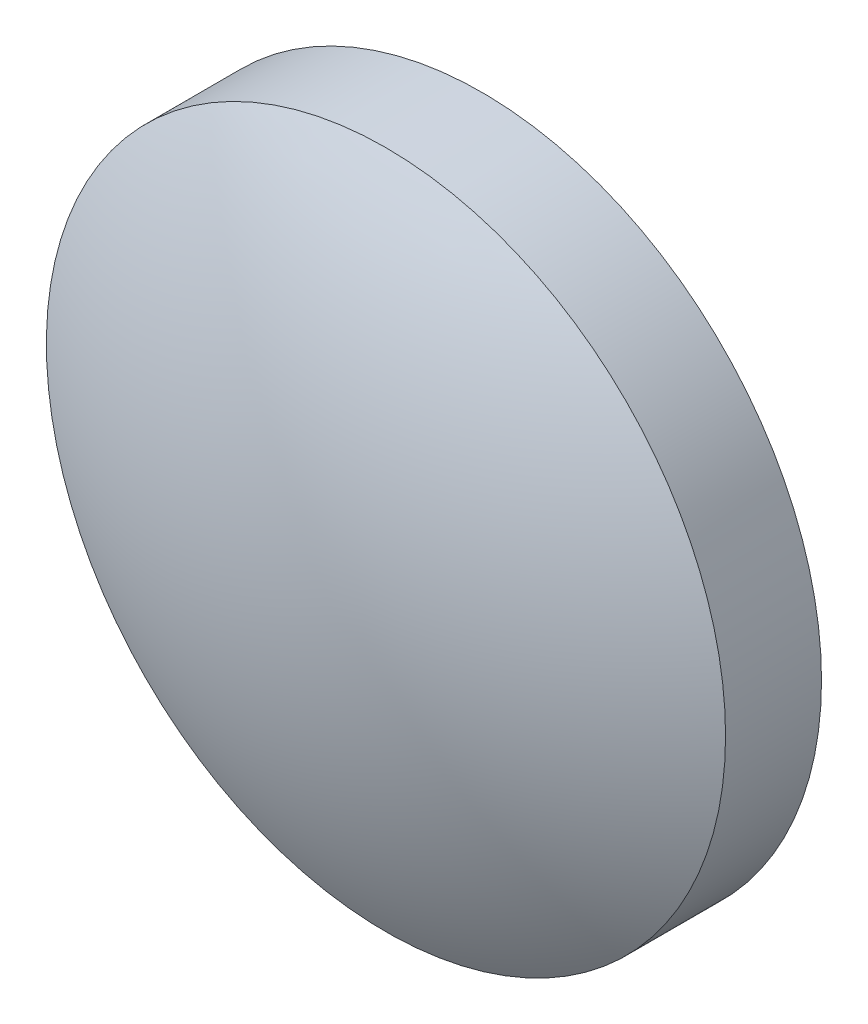
ISO-10303-21;
HEADER;
FILE_DESCRIPTION(('STEP AP214'),'2;1');
FILE_NAME('part.step','',(''),(''),'','','');
FILE_SCHEMA(('AUTOMOTIVE_DESIGN { 1 0 10303 214 1 1 1 1 }'));
ENDSEC;
DATA;
#1=APPLICATION_CONTEXT('core data for automotive mechanical design processes');
#2=APPLICATION_PROTOCOL_DEFINITION('international standard','automotive_design',2000,#1);
#3=PRODUCT_CONTEXT('',#1,'mechanical');
#4=PRODUCT('Part','Part','',(#3));
#5=PRODUCT_RELATED_PRODUCT_CATEGORY('part','',(#4));
#6=PRODUCT_DEFINITION_FORMATION('','',#4);
#7=PRODUCT_DEFINITION_CONTEXT('part definition',#1,'design');
#8=PRODUCT_DEFINITION('design','',#6,#7);
#9=PRODUCT_DEFINITION_SHAPE('','',#8);
#10=(LENGTH_UNIT() NAMED_UNIT(*) SI_UNIT(.MILLI.,.METRE.));
#11=(NAMED_UNIT(*) PLANE_ANGLE_UNIT() SI_UNIT($,.RADIAN.));
#12=(NAMED_UNIT(*) SI_UNIT($,.STERADIAN.) SOLID_ANGLE_UNIT());
#13=UNCERTAINTY_MEASURE_WITH_UNIT(LENGTH_MEASURE(1.E-05),#10,'distance_accuracy_value','');
#14=(GEOMETRIC_REPRESENTATION_CONTEXT(3) GLOBAL_UNCERTAINTY_ASSIGNED_CONTEXT((#13)) GLOBAL_UNIT_ASSIGNED_CONTEXT((#10,
#11,#12)) REPRESENTATION_CONTEXT('',''));
#15=CARTESIAN_POINT('',(0.,0.,0.));
#16=DIRECTION('',(0.,0.,1.));
#17=DIRECTION('',(1.,0.,0.));
#18=AXIS2_PLACEMENT_3D('',#15,#16,#17);
#19=CARTESIAN_POINT('',(0.,0.,-11.135));
#20=DIRECTION('',(0.,0.,1.));
#21=DIRECTION('',(0.,1.,0.));
#22=AXIS2_PLACEMENT_3D('',#19,#20,#21);
#23=SPHERICAL_SURFACE('',#22,12.87);
#24=CARTESIAN_POINT('',(0.,0.,0.0593914528660292));
#25=DIRECTION('',(0.,0.,1.));
#26=DIRECTION('',(1.,0.,0.));
#27=AXIS2_PLACEMENT_3D('',#24,#25,#26);
#28=CIRCLE('',#27,6.35);
#29=CARTESIAN_POINT('',(6.35,0.,0.0593914528660292));
#30=VERTEX_POINT('',#29);
#31=EDGE_CURVE('E8',#30,#30,#28,.T.);
#32=ORIENTED_EDGE('',*,*,#31,.T.);
#33=EDGE_LOOP('',(#32));
#34=FACE_BOUND('',#33,.T.);
#35=ADVANCED_FACE('F12',(#34),#23,.T.);
#36=CARTESIAN_POINT('',(0.,0.,4.30813204540037));
#37=DIRECTION('',(0.,0.,1.));
#38=DIRECTION('',(1.,0.,0.));
#39=AXIS2_PLACEMENT_3D('',#36,#37,#38);
#40=CYLINDRICAL_SURFACE('',#39,6.35);
#41=ORIENTED_EDGE('',*,*,#31,.F.);
#42=EDGE_LOOP('',(#41));
#43=FACE_BOUND('',#42,.T.);
#44=CARTESIAN_POINT('',(0.,0.,-1.735));
#45=DIRECTION('',(0.,0.,1.));
#46=DIRECTION('',(1.,0.,0.));
#47=AXIS2_PLACEMENT_3D('',#44,#45,#46);
#48=CIRCLE('',#47,6.35);
#49=CARTESIAN_POINT('',(6.35,0.,-1.735));
#50=VERTEX_POINT('',#49);
#51=EDGE_CURVE('E18',#50,#50,#48,.T.);
#52=ORIENTED_EDGE('',*,*,#51,.T.);
#53=EDGE_LOOP('',(#52));
#54=FACE_BOUND('',#53,.T.);
#55=ADVANCED_FACE('F24',(#43,#54),#40,.T.);
#56=CARTESIAN_POINT('',(0.,0.,-1.735));
#57=DIRECTION('',(0.,0.,1.));
#58=DIRECTION('',(1.,0.,0.));
#59=AXIS2_PLACEMENT_3D('',#56,#57,#58);
#60=PLANE('',#59);
#61=ORIENTED_EDGE('',*,*,#51,.F.);
#62=EDGE_LOOP('',(#61));
#63=FACE_BOUND('',#62,.T.);
#64=ADVANCED_FACE('F26',(#63),#60,.F.);
#65=CLOSED_SHELL('',(#35,#55,#64));
#66=MANIFOLD_SOLID_BREP('B1',#65);
#67=ADVANCED_BREP_SHAPE_REPRESENTATION('',(#18,#66),#14);
#68=SHAPE_DEFINITION_REPRESENTATION(#9,#67);
ENDSEC;
END-ISO-10303-21;
